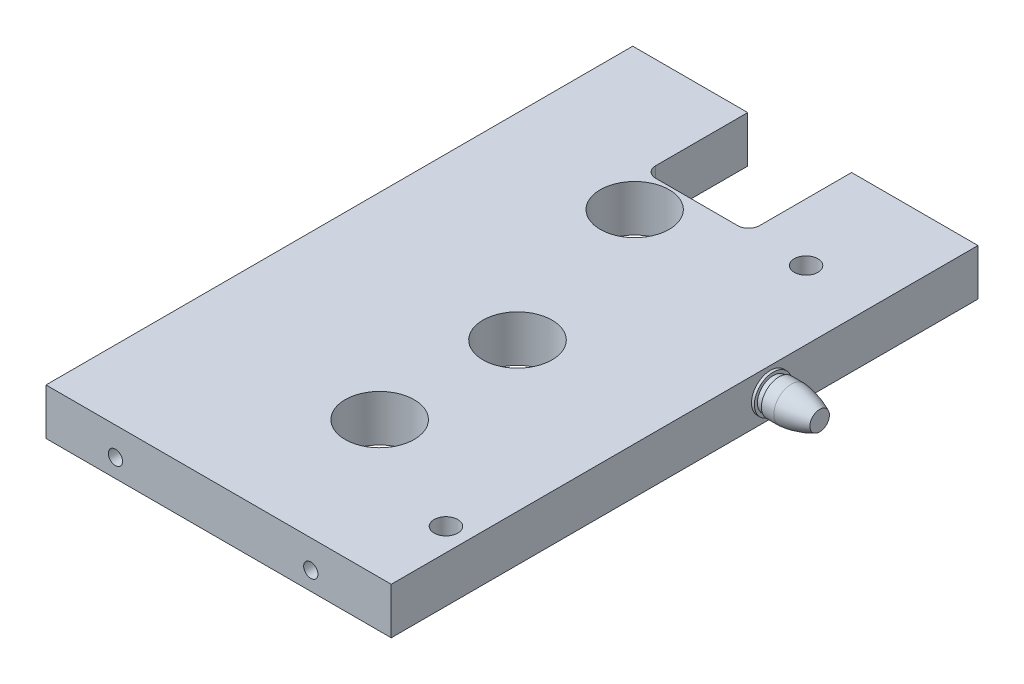
ISO-10303-21;
HEADER;
FILE_DESCRIPTION(('STEP AP214'),'2;1');
FILE_NAME('part.step','',(''),(''),'','','');
FILE_SCHEMA(('AUTOMOTIVE_DESIGN { 1 0 10303 214 1 1 1 1 }'));
ENDSEC;
DATA;
#1=APPLICATION_CONTEXT('core data for automotive mechanical design processes');
#2=APPLICATION_PROTOCOL_DEFINITION('international standard','automotive_design',2000,#1);
#3=PRODUCT_CONTEXT('',#1,'mechanical');
#4=PRODUCT('Part','Part','',(#3));
#5=PRODUCT_RELATED_PRODUCT_CATEGORY('part','',(#4));
#6=PRODUCT_DEFINITION_FORMATION('','',#4);
#7=PRODUCT_DEFINITION_CONTEXT('part definition',#1,'design');
#8=PRODUCT_DEFINITION('design','',#6,#7);
#9=PRODUCT_DEFINITION_SHAPE('','',#8);
#10=(LENGTH_UNIT() NAMED_UNIT(*) SI_UNIT(.MILLI.,.METRE.));
#11=(NAMED_UNIT(*) PLANE_ANGLE_UNIT() SI_UNIT($,.RADIAN.));
#12=(NAMED_UNIT(*) SI_UNIT($,.STERADIAN.) SOLID_ANGLE_UNIT());
#13=UNCERTAINTY_MEASURE_WITH_UNIT(LENGTH_MEASURE(1.E-05),#10,'distance_accuracy_value','');
#14=(GEOMETRIC_REPRESENTATION_CONTEXT(3) GLOBAL_UNCERTAINTY_ASSIGNED_CONTEXT((#13)) GLOBAL_UNIT_ASSIGNED_CONTEXT((#10,
#11,#12)) REPRESENTATION_CONTEXT('',''));
#15=CARTESIAN_POINT('',(0.,0.,0.));
#16=DIRECTION('',(0.,0.,1.));
#17=DIRECTION('',(1.,0.,0.));
#18=AXIS2_PLACEMENT_3D('',#15,#16,#17);
#19=CARTESIAN_POINT('',(-257.2,-82.5,28.9681240867132));
#20=DIRECTION('',(0.,0.,-1.));
#21=DIRECTION('',(-1.,0.,0.));
#22=AXIS2_PLACEMENT_3D('',#19,#20,#21);
#23=CYLINDRICAL_SURFACE('',#22,3.09999999999999);
#24=CARTESIAN_POINT('',(-257.2,-82.5,0.));
#25=DIRECTION('',(0.,0.,1.));
#26=DIRECTION('',(1.,0.,0.));
#27=AXIS2_PLACEMENT_3D('',#24,#25,#26);
#28=CIRCLE('',#27,3.09999999999999);
#29=CARTESIAN_POINT('',(-254.1,-82.5,0.));
#30=VERTEX_POINT('',#29);
#31=EDGE_CURVE('E217',#30,#30,#28,.T.);
#32=ORIENTED_EDGE('',*,*,#31,.F.);
#33=EDGE_LOOP('',(#32));
#34=FACE_BOUND('',#33,.T.);
#35=CARTESIAN_POINT('',(-257.2,-82.5,20.2));
#36=DIRECTION('',(0.,0.,1.));
#37=DIRECTION('',(1.,0.,0.));
#38=AXIS2_PLACEMENT_3D('',#35,#36,#37);
#39=CIRCLE('',#38,3.09999999999999);
#40=CARTESIAN_POINT('',(-256.848432083375,-85.58,20.2));
#41=VERTEX_POINT('',#40);
#42=CARTESIAN_POINT('',(-257.551567916625,-85.58,20.2));
#43=VERTEX_POINT('',#42);
#44=EDGE_CURVE('E138',#41,#43,#39,.T.);
#45=ORIENTED_EDGE('',*,*,#44,.T.);
#46=DIRECTION('',(0.,0.,-1.));
#47=VECTOR('',#46,1.);
#48=CARTESIAN_POINT('',(-257.551567916625,-85.58,28.9681240867132));
#49=LINE('',#48,#47);
#50=CARTESIAN_POINT('',(-257.551567916625,-85.58,19.8613272153188));
#51=VERTEX_POINT('',#50);
#52=EDGE_CURVE('E50',#43,#51,#49,.T.);
#53=ORIENTED_EDGE('',*,*,#52,.T.);
#54=CARTESIAN_POINT('',(-256.848432083375,-85.58,19.5693427331078));
#55=CARTESIAN_POINT('',(-256.907836533533,-85.5867825790089,19.5912680193791));
#56=CARTESIAN_POINT('',(-256.96719185592,-85.5918149847107,19.6138537564495));
#57=CARTESIAN_POINT('',(-257.085419115516,-85.5984451808167,19.6602024908549));
#58=CARTESIAN_POINT('',(-257.144291985608,-85.6000537146995,19.6839615656487));
#59=CARTESIAN_POINT('',(-257.261543057596,-85.599943539512,19.7326512016025));
#60=CARTESIAN_POINT('',(-257.319921276302,-85.5982249439608,19.7575817227653));
#61=CARTESIAN_POINT('',(-257.436197094981,-85.591539167004,19.8086127408628));
#62=CARTESIAN_POINT('',(-257.494092599788,-85.5865617621281,19.8347166781873));
#63=CARTESIAN_POINT('',(-257.551567916625,-85.58,19.8613272153188));
#64=B_SPLINE_CURVE_WITH_KNOTS('',3,(#54,#55,#56,#57,#58,#59,#60,#61,#62,#63),.UNSPECIFIED.,.F.,
.F.,(4,2,2,2,4),(0.,0.191016695142209,0.381433126124509,0.571843060357759,0.762853225634808),.UNSPECIFIED.);
#65=CARTESIAN_POINT('',(-256.848432083375,-85.58,19.5693427331078));
#66=VERTEX_POINT('',#65);
#67=EDGE_CURVE('E11',#66,#51,#64,.T.);
#68=ORIENTED_EDGE('',*,*,#67,.F.);
#69=DIRECTION('',(0.,0.,-1.));
#70=VECTOR('',#69,1.);
#71=CARTESIAN_POINT('',(-256.848432083375,-85.58,28.9681240867132));
#72=LINE('',#71,#70);
#73=EDGE_CURVE('E132',#66,#41,#72,.F.);
#74=ORIENTED_EDGE('',*,*,#73,.T.);
#75=EDGE_LOOP('',(#45,#53,#68,#74));
#76=FACE_BOUND('',#75,.T.);
#77=ADVANCED_FACE('F30',(#34,#76),#23,.F.);
#78=CARTESIAN_POINT('',(-282.25,-691.394504988286,20.2));
#79=DIRECTION('',(0.,0.,1.));
#80=DIRECTION('',(1.,0.,0.));
#81=AXIS2_PLACEMENT_3D('',#78,#79,#80);
#82=PLANE('',#81);
#83=DIRECTION('',(1.,0.,0.));
#84=VECTOR('',#83,1.);
#85=CARTESIAN_POINT('',(-282.25,-85.58,20.2));
#86=LINE('',#85,#84);
#87=EDGE_CURVE('E144',#43,#41,#86,.T.);
#88=ORIENTED_EDGE('',*,*,#87,.F.);
#89=ORIENTED_EDGE('',*,*,#44,.F.);
#90=EDGE_LOOP('',(#88,#89));
#91=FACE_BOUND('',#90,.T.);
#92=ADVANCED_FACE('F377',(#91),#82,.F.);
#93=CARTESIAN_POINT('',(-253.55,-88.901,28.505));
#94=DIRECTION('',(0.,1.,0.));
#95=DIRECTION('',(-1.,0.,0.));
#96=AXIS2_PLACEMENT_3D('',#93,#94,#95);
#97=CYLINDRICAL_SURFACE('',#96,3.26500000000004);
#98=CARTESIAN_POINT('',(-253.55,-76.1000000000001,28.505));
#99=DIRECTION('',(0.,1.,0.));
#100=DIRECTION('',(-1.,0.,0.));
#101=AXIS2_PLACEMENT_3D('',#98,#99,#100);
#102=CIRCLE('',#101,3.26500000000004);
#103=CARTESIAN_POINT('',(-256.815,-76.1000000000001,28.505));
#104=VERTEX_POINT('',#103);
#105=EDGE_CURVE('E149',#104,#104,#102,.T.);
#106=ORIENTED_EDGE('',*,*,#105,.T.);
#107=EDGE_LOOP('',(#106));
#108=FACE_BOUND('',#107,.T.);
#109=CARTESIAN_POINT('',(-253.55,-85.58,28.505));
#110=DIRECTION('',(0.,-1.,0.));
#111=DIRECTION('',(1.,0.,0.));
#112=AXIS2_PLACEMENT_3D('',#109,#110,#111);
#113=CIRCLE('',#112,3.26500000000004);
#114=CARTESIAN_POINT('',(-250.285,-85.58,28.505));
#115=VERTEX_POINT('',#114);
#116=EDGE_CURVE('E133',#115,#115,#113,.F.);
#117=ORIENTED_EDGE('',*,*,#116,.F.);
#118=EDGE_LOOP('',(#117));
#119=FACE_BOUND('',#118,.T.);
#120=ADVANCED_FACE('F382',(#108,#119),#97,.F.);
#121=CARTESIAN_POINT('',(-234.625,-76.1,0.));
#122=DIRECTION('',(0.,0.,1.));
#123=DIRECTION('',(1.,0.,0.));
#124=AXIS2_PLACEMENT_3D('',#121,#122,#123);
#125=PLANE('',#124);
#126=CARTESIAN_POINT('',(-320.5,-82.5,0.));
#127=DIRECTION('',(0.,0.,1.));
#128=DIRECTION('',(1.,0.,0.));
#129=AXIS2_PLACEMENT_3D('',#126,#127,#128);
#130=CIRCLE('',#129,2.39499999999998);
#131=CARTESIAN_POINT('',(-318.105,-82.5,0.));
#132=VERTEX_POINT('',#131);
#133=EDGE_CURVE('E205',#132,#132,#130,.T.);
#134=ORIENTED_EDGE('',*,*,#133,.T.);
#135=EDGE_LOOP('',(#134));
#136=FACE_BOUND('',#135,.T.);
#137=CARTESIAN_POINT('',(-308.,-82.5,0.));
#138=DIRECTION('',(0.,0.,1.));
#139=DIRECTION('',(1.,0.,0.));
#140=AXIS2_PLACEMENT_3D('',#137,#138,#139);
#141=CIRCLE('',#140,3.09999999999999);
#142=CARTESIAN_POINT('',(-304.9,-82.5,0.));
#143=VERTEX_POINT('',#142);
#144=EDGE_CURVE('E221',#143,#143,#141,.T.);
#145=ORIENTED_EDGE('',*,*,#144,.T.);
#146=EDGE_LOOP('',(#145));
#147=FACE_BOUND('',#146,.T.);
#148=DIRECTION('',(-1.,0.,0.));
#149=VECTOR('',#148,1.);
#150=CARTESIAN_POINT('',(-234.625,-76.1,0.));
#151=LINE('',#150,#149);
#152=CARTESIAN_POINT('',(-298.155,-76.1000000000001,0.));
#153=VERTEX_POINT('',#152);
#154=CARTESIAN_POINT('',(-329.875,-76.1000000000001,0.));
#155=VERTEX_POINT('',#154);
#156=EDGE_CURVE('E240',#153,#155,#151,.T.);
#157=ORIENTED_EDGE('',*,*,#156,.F.);
#158=DIRECTION('',(0.,1.,0.));
#159=VECTOR('',#158,1.);
#160=CARTESIAN_POINT('',(-298.155,-88.901,0.));
#161=LINE('',#160,#159);
#162=CARTESIAN_POINT('',(-298.155,-88.9,0.));
#163=VERTEX_POINT('',#162);
#164=EDGE_CURVE('E197',#163,#153,#161,.T.);
#165=ORIENTED_EDGE('',*,*,#164,.F.);
#166=DIRECTION('',(-1.,0.,0.));
#167=VECTOR('',#166,1.);
#168=CARTESIAN_POINT('',(-234.625,-88.8999999999999,0.));
#169=LINE('',#168,#167);
#170=CARTESIAN_POINT('',(-329.875,-88.9,0.));
#171=VERTEX_POINT('',#170);
#172=EDGE_CURVE('E232',#163,#171,#169,.T.);
#173=ORIENTED_EDGE('',*,*,#172,.T.);
#174=DIRECTION('',(0.,1.,0.));
#175=VECTOR('',#174,1.);
#176=CARTESIAN_POINT('',(-329.875,-88.9,0.));
#177=LINE('',#176,#175);
#178=EDGE_CURVE('E231',#171,#155,#177,.T.);
#179=ORIENTED_EDGE('',*,*,#178,.T.);
#180=EDGE_LOOP('',(#157,#165,#173,#179));
#181=FACE_BOUND('',#180,.T.);
#182=ADVANCED_FACE('F341',(#136,#147,#181),#125,.F.);
#183=CARTESIAN_POINT('',(-244.2,-82.5,0.));
#184=DIRECTION('',(0.,0.,1.));
#185=DIRECTION('',(1.,0.,0.));
#186=AXIS2_PLACEMENT_3D('',#183,#184,#185);
#187=CIRCLE('',#186,2.39499999999998);
#188=CARTESIAN_POINT('',(-241.805,-82.5,0.));
#189=VERTEX_POINT('',#188);
#190=EDGE_CURVE('E211',#189,#189,#187,.T.);
#191=ORIENTED_EDGE('',*,*,#190,.T.);
#192=EDGE_LOOP('',(#191));
#193=FACE_BOUND('',#192,.T.);
#194=CARTESIAN_POINT('',(-234.625,-88.8999999999999,0.));
#195=VERTEX_POINT('',#194);
#196=CARTESIAN_POINT('',(-269.505,-88.8999999999999,0.));
#197=VERTEX_POINT('',#196);
#198=EDGE_CURVE('E228',#195,#197,#169,.T.);
#199=ORIENTED_EDGE('',*,*,#198,.T.);
#200=DIRECTION('',(0.,1.,0.));
#201=VECTOR('',#200,1.);
#202=CARTESIAN_POINT('',(-269.505,-88.901,0.));
#203=LINE('',#202,#201);
#204=CARTESIAN_POINT('',(-269.505,-76.1000000000001,0.));
#205=VERTEX_POINT('',#204);
#206=EDGE_CURVE('E199',#197,#205,#203,.T.);
#207=ORIENTED_EDGE('',*,*,#206,.T.);
#208=CARTESIAN_POINT('',(-234.625,-76.1,0.));
#209=VERTEX_POINT('',#208);
#210=EDGE_CURVE('E236',#209,#205,#151,.T.);
#211=ORIENTED_EDGE('',*,*,#210,.F.);
#212=DIRECTION('',(0.,1.,0.));
#213=VECTOR('',#212,1.);
#214=CARTESIAN_POINT('',(-234.625,-88.8999999999999,0.));
#215=LINE('',#214,#213);
#216=EDGE_CURVE('E43',#195,#209,#215,.T.);
#217=ORIENTED_EDGE('',*,*,#216,.F.);
#218=EDGE_LOOP('',(#199,#207,#211,#217));
#219=FACE_BOUND('',#218,.T.);
#220=ORIENTED_EDGE('',*,*,#31,.T.);
#221=EDGE_LOOP('',(#220));
#222=FACE_BOUND('',#221,.T.);
#223=ADVANCED_FACE('F357',(#193,#219,#222),#125,.F.);
#224=CARTESIAN_POINT('',(-329.875,-610.1,161.88));
#225=DIRECTION('',(0.,0.,1.));
#226=DIRECTION('',(1.,0.,0.));
#227=AXIS2_PLACEMENT_3D('',#224,#225,#226);
#228=PLANE('',#227);
#229=CARTESIAN_POINT('',(-310.715,-83.83,161.88));
#230=DIRECTION('',(0.,0.,1.));
#231=DIRECTION('',(1.,0.,0.));
#232=AXIS2_PLACEMENT_3D('',#229,#230,#231);
#233=CIRCLE('',#232,1.965);
#234=CARTESIAN_POINT('',(-308.75,-83.83,161.88));
#235=VERTEX_POINT('',#234);
#236=EDGE_CURVE('E273',#235,#235,#233,.T.);
#237=ORIENTED_EDGE('',*,*,#236,.F.);
#238=EDGE_LOOP('',(#237));
#239=FACE_BOUND('',#238,.T.);
#240=CARTESIAN_POINT('',(-256.825,-83.83,161.88));
#241=DIRECTION('',(0.,0.,1.));
#242=DIRECTION('',(1.,0.,0.));
#243=AXIS2_PLACEMENT_3D('',#240,#241,#242);
#244=CIRCLE('',#243,1.965);
#245=CARTESIAN_POINT('',(-254.86,-83.83,161.88));
#246=VERTEX_POINT('',#245);
#247=EDGE_CURVE('E267',#246,#246,#244,.T.);
#248=ORIENTED_EDGE('',*,*,#247,.F.);
#249=EDGE_LOOP('',(#248));
#250=FACE_BOUND('',#249,.T.);
#251=DIRECTION('',(-1.,0.,0.));
#252=VECTOR('',#251,1.);
#253=CARTESIAN_POINT('',(-234.625,-88.8999999999999,161.88));
#254=LINE('',#253,#252);
#255=CARTESIAN_POINT('',(-234.625,-88.8999999999999,161.88));
#256=VERTEX_POINT('',#255);
#257=CARTESIAN_POINT('',(-329.875,-88.9,161.88));
#258=VERTEX_POINT('',#257);
#259=EDGE_CURVE('E235',#256,#258,#254,.T.);
#260=ORIENTED_EDGE('',*,*,#259,.F.);
#261=DIRECTION('',(0.,1.,0.));
#262=VECTOR('',#261,1.);
#263=CARTESIAN_POINT('',(-234.625,-88.8999999999999,161.88));
#264=LINE('',#263,#262);
#265=CARTESIAN_POINT('',(-234.625,-76.1,161.88));
#266=VERTEX_POINT('',#265);
#267=EDGE_CURVE('E227',#256,#266,#264,.T.);
#268=ORIENTED_EDGE('',*,*,#267,.T.);
#269=DIRECTION('',(-1.,0.,0.));
#270=VECTOR('',#269,1.);
#271=CARTESIAN_POINT('',(-234.625,-76.1,161.88));
#272=LINE('',#271,#270);
#273=CARTESIAN_POINT('',(-329.875,-76.1000000000001,161.88));
#274=VERTEX_POINT('',#273);
#275=EDGE_CURVE('E247',#266,#274,#272,.T.);
#276=ORIENTED_EDGE('',*,*,#275,.T.);
#277=DIRECTION('',(0.,1.,0.));
#278=VECTOR('',#277,1.);
#279=CARTESIAN_POINT('',(-329.875,-88.9,161.88));
#280=LINE('',#279,#278);
#281=EDGE_CURVE('E249',#258,#274,#280,.T.);
#282=ORIENTED_EDGE('',*,*,#281,.F.);
#283=EDGE_LOOP('',(#260,#268,#276,#282));
#284=FACE_BOUND('',#283,.T.);
#285=ADVANCED_FACE('F32',(#239,#250,#284),#228,.T.);
#286=CARTESIAN_POINT('',(-234.625,-88.8999999999999,257.98620427423));
#287=DIRECTION('',(0.,-1.,0.));
#288=DIRECTION('',(1.,0.,0.));
#289=AXIS2_PLACEMENT_3D('',#286,#287,#288);
#290=PLANE('',#289);
#291=CARTESIAN_POINT('',(-290.57,-88.9,38.77));
#292=DIRECTION('',(0.,1.,0.));
#293=DIRECTION('',(-1.,0.,0.));
#294=AXIS2_PLACEMENT_3D('',#291,#292,#293);
#295=CIRCLE('',#294,9.50000000000001);
#296=CARTESIAN_POINT('',(-300.07,-88.9,38.77));
#297=VERTEX_POINT('',#296);
#298=EDGE_CURVE('E297',#297,#297,#295,.T.);
#299=ORIENTED_EDGE('',*,*,#298,.T.);
#300=EDGE_LOOP('',(#299));
#301=FACE_BOUND('',#300,.T.);
#302=CARTESIAN_POINT('',(-253.55,-88.9,28.505));
#303=DIRECTION('',(0.,-1.,0.));
#304=DIRECTION('',(1.,0.,0.));
#305=AXIS2_PLACEMENT_3D('',#302,#303,#304);
#306=CIRCLE('',#305,9.52500000000002);
#307=CARTESIAN_POINT('',(-244.025,-88.9,28.505));
#308=VERTEX_POINT('',#307);
#309=EDGE_CURVE('E134',#308,#308,#306,.T.);
#310=ORIENTED_EDGE('',*,*,#309,.F.);
#311=EDGE_LOOP('',(#310));
#312=FACE_BOUND('',#311,.T.);
#313=CARTESIAN_POINT('',(-240.925,-88.8999999999999,140.49));
#314=DIRECTION('',(0.,-1.,0.));
#315=DIRECTION('',(1.,0.,0.));
#316=AXIS2_PLACEMENT_3D('',#313,#314,#315);
#317=CIRCLE('',#316,3.26500000000004);
#318=CARTESIAN_POINT('',(-237.66,-88.8999999999999,140.49));
#319=VERTEX_POINT('',#318);
#320=EDGE_CURVE('E139',#319,#319,#317,.F.);
#321=ORIENTED_EDGE('',*,*,#320,.T.);
#322=EDGE_LOOP('',(#321));
#323=FACE_BOUND('',#322,.T.);
#324=CARTESIAN_POINT('',(-275.57,-88.8999999999999,124.135));
#325=DIRECTION('',(0.,-1.,0.));
#326=DIRECTION('',(1.,0.,0.));
#327=AXIS2_PLACEMENT_3D('',#324,#325,#326);
#328=CIRCLE('',#327,9.52500000000002);
#329=CARTESIAN_POINT('',(-266.045,-88.8999999999999,124.135));
#330=VERTEX_POINT('',#329);
#331=EDGE_CURVE('E153',#330,#330,#328,.F.);
#332=ORIENTED_EDGE('',*,*,#331,.T.);
#333=EDGE_LOOP('',(#332));
#334=FACE_BOUND('',#333,.T.);
#335=CARTESIAN_POINT('',(-275.57,-88.8999999999999,86.105));
#336=DIRECTION('',(0.,-1.,0.));
#337=DIRECTION('',(1.,0.,0.));
#338=AXIS2_PLACEMENT_3D('',#335,#336,#337);
#339=CIRCLE('',#338,9.52500000000002);
#340=CARTESIAN_POINT('',(-266.045,-88.8999999999999,86.105));
#341=VERTEX_POINT('',#340);
#342=EDGE_CURVE('E157',#341,#341,#339,.F.);
#343=ORIENTED_EDGE('',*,*,#342,.T.);
#344=EDGE_LOOP('',(#343));
#345=FACE_BOUND('',#344,.T.);
#346=DIRECTION('',(0.,0.,1.));
#347=VECTOR('',#346,1.);
#348=CARTESIAN_POINT('',(-298.155,-88.9,0.));
#349=LINE('',#348,#347);
#350=CARTESIAN_POINT('',(-298.155,-88.9,25.4));
#351=VERTEX_POINT('',#350);
#352=EDGE_CURVE('E174',#163,#351,#349,.T.);
#353=ORIENTED_EDGE('',*,*,#352,.T.);
#354=CARTESIAN_POINT('',(-295.155,-88.9,25.4));
#355=DIRECTION('',(0.,-1.,0.));
#356=DIRECTION('',(1.,0.,0.));
#357=AXIS2_PLACEMENT_3D('',#354,#355,#356);
#358=CIRCLE('',#357,3.);
#359=CARTESIAN_POINT('',(-295.155,-88.9,28.4));
#360=VERTEX_POINT('',#359);
#361=EDGE_CURVE('E171',#351,#360,#358,.F.);
#362=ORIENTED_EDGE('',*,*,#361,.T.);
#363=DIRECTION('',(1.,0.,0.));
#364=VECTOR('',#363,1.);
#365=CARTESIAN_POINT('',(-295.155,-88.9,28.4));
#366=LINE('',#365,#364);
#367=CARTESIAN_POINT('',(-272.505,-88.8999999999999,28.4));
#368=VERTEX_POINT('',#367);
#369=EDGE_CURVE('E168',#360,#368,#366,.T.);
#370=ORIENTED_EDGE('',*,*,#369,.T.);
#371=CARTESIAN_POINT('',(-272.505,-88.8999999999999,25.4));
#372=DIRECTION('',(0.,-1.,0.));
#373=DIRECTION('',(1.,0.,0.));
#374=AXIS2_PLACEMENT_3D('',#371,#372,#373);
#375=CIRCLE('',#374,3.);
#376=CARTESIAN_POINT('',(-269.505,-88.8999999999999,25.4));
#377=VERTEX_POINT('',#376);
#378=EDGE_CURVE('E163',#368,#377,#375,.F.);
#379=ORIENTED_EDGE('',*,*,#378,.T.);
#380=DIRECTION('',(0.,0.,-1.));
#381=VECTOR('',#380,1.);
#382=CARTESIAN_POINT('',(-269.505,-88.8999999999999,25.4));
#383=LINE('',#382,#381);
#384=EDGE_CURVE('E192',#377,#197,#383,.T.);
#385=ORIENTED_EDGE('',*,*,#384,.T.);
#386=ORIENTED_EDGE('',*,*,#198,.F.);
#387=DIRECTION('',(0.,0.,-1.));
#388=VECTOR('',#387,1.);
#389=CARTESIAN_POINT('',(-234.625,-88.8999999999999,257.98620427423));
#390=LINE('',#389,#388);
#391=EDGE_CURVE('E239',#256,#195,#390,.T.);
#392=ORIENTED_EDGE('',*,*,#391,.F.);
#393=ORIENTED_EDGE('',*,*,#259,.T.);
#394=DIRECTION('',(0.,0.,-1.));
#395=VECTOR('',#394,1.);
#396=CARTESIAN_POINT('',(-329.875,-88.9,257.98620427423));
#397=LINE('',#396,#395);
#398=EDGE_CURVE('E245',#258,#171,#397,.T.);
#399=ORIENTED_EDGE('',*,*,#398,.T.);
#400=ORIENTED_EDGE('',*,*,#172,.F.);
#401=EDGE_LOOP('',(#353,#362,#370,#379,#385,#386,#392,#393,#399,#400));
#402=FACE_BOUND('',#401,.T.);
#403=ADVANCED_FACE('F304',(#301,#312,#323,#334,#345,#402),#290,.T.);
#404=CARTESIAN_POINT('',(-329.875,-88.9,257.98620427423));
#405=DIRECTION('',(-1.,0.,0.));
#406=DIRECTION('',(0.,0.,1.));
#407=AXIS2_PLACEMENT_3D('',#404,#405,#406);
#408=PLANE('',#407);
#409=ORIENTED_EDGE('',*,*,#398,.F.);
#410=ORIENTED_EDGE('',*,*,#281,.T.);
#411=DIRECTION('',(0.,0.,-1.));
#412=VECTOR('',#411,1.);
#413=CARTESIAN_POINT('',(-329.875,-76.1000000000001,257.98620427423));
#414=LINE('',#413,#412);
#415=EDGE_CURVE('E252',#274,#155,#414,.T.);
#416=ORIENTED_EDGE('',*,*,#415,.T.);
#417=ORIENTED_EDGE('',*,*,#178,.F.);
#418=EDGE_LOOP('',(#409,#410,#416,#417));
#419=FACE_BOUND('',#418,.T.);
#420=ADVANCED_FACE('F318',(#419),#408,.T.);
#421=CARTESIAN_POINT('',(-234.625,-76.1,257.98620427423));
#422=DIRECTION('',(0.,-1.,0.));
#423=DIRECTION('',(1.,0.,0.));
#424=AXIS2_PLACEMENT_3D('',#421,#422,#423);
#425=PLANE('',#424);
#426=CARTESIAN_POINT('',(-290.57,-76.1000000000001,38.77));
#427=DIRECTION('',(0.,1.,0.));
#428=DIRECTION('',(-1.,0.,0.));
#429=AXIS2_PLACEMENT_3D('',#426,#427,#428);
#430=CIRCLE('',#429,9.50000000000001);
#431=CARTESIAN_POINT('',(-300.07,-76.1000000000001,38.77));
#432=VERTEX_POINT('',#431);
#433=EDGE_CURVE('E298',#432,#432,#430,.T.);
#434=ORIENTED_EDGE('',*,*,#433,.F.);
#435=EDGE_LOOP('',(#434));
#436=FACE_BOUND('',#435,.T.);
#437=CARTESIAN_POINT('',(-240.925,-76.1000000000001,140.49));
#438=DIRECTION('',(0.,1.,0.));
#439=DIRECTION('',(-1.,0.,0.));
#440=AXIS2_PLACEMENT_3D('',#437,#438,#439);
#441=CIRCLE('',#440,3.26500000000004);
#442=CARTESIAN_POINT('',(-244.19,-76.1000000000001,140.49));
#443=VERTEX_POINT('',#442);
#444=EDGE_CURVE('E142',#443,#443,#441,.T.);
#445=ORIENTED_EDGE('',*,*,#444,.F.);
#446=EDGE_LOOP('',(#445));
#447=FACE_BOUND('',#446,.T.);
#448=ORIENTED_EDGE('',*,*,#105,.F.);
#449=EDGE_LOOP('',(#448));
#450=FACE_BOUND('',#449,.T.);
#451=CARTESIAN_POINT('',(-275.57,-76.1000000000001,124.135));
#452=DIRECTION('',(0.,1.,0.));
#453=DIRECTION('',(-1.,0.,0.));
#454=AXIS2_PLACEMENT_3D('',#451,#452,#453);
#455=CIRCLE('',#454,9.52500000000002);
#456=CARTESIAN_POINT('',(-285.095,-76.1000000000001,124.135));
#457=VERTEX_POINT('',#456);
#458=EDGE_CURVE('E154',#457,#457,#455,.T.);
#459=ORIENTED_EDGE('',*,*,#458,.F.);
#460=EDGE_LOOP('',(#459));
#461=FACE_BOUND('',#460,.T.);
#462=CARTESIAN_POINT('',(-275.57,-76.1000000000001,86.105));
#463=DIRECTION('',(0.,1.,0.));
#464=DIRECTION('',(-1.,0.,0.));
#465=AXIS2_PLACEMENT_3D('',#462,#463,#464);
#466=CIRCLE('',#465,9.52500000000002);
#467=CARTESIAN_POINT('',(-285.095,-76.1000000000001,86.105));
#468=VERTEX_POINT('',#467);
#469=EDGE_CURVE('E160',#468,#468,#466,.T.);
#470=ORIENTED_EDGE('',*,*,#469,.F.);
#471=EDGE_LOOP('',(#470));
#472=FACE_BOUND('',#471,.T.);
#473=CARTESIAN_POINT('',(-295.155,-76.1000000000001,25.4));
#474=DIRECTION('',(0.,1.,0.));
#475=DIRECTION('',(-1.,0.,0.));
#476=AXIS2_PLACEMENT_3D('',#473,#474,#475);
#477=CIRCLE('',#476,3.);
#478=CARTESIAN_POINT('',(-298.155,-76.1000000000001,25.4));
#479=VERTEX_POINT('',#478);
#480=CARTESIAN_POINT('',(-295.155,-76.1000000000001,28.4));
#481=VERTEX_POINT('',#480);
#482=EDGE_CURVE('E183',#479,#481,#477,.T.);
#483=ORIENTED_EDGE('',*,*,#482,.F.);
#484=DIRECTION('',(0.,0.,1.));
#485=VECTOR('',#484,1.);
#486=CARTESIAN_POINT('',(-298.155,-76.1000000000001,0.));
#487=LINE('',#486,#485);
#488=EDGE_CURVE('E180',#153,#479,#487,.T.);
#489=ORIENTED_EDGE('',*,*,#488,.F.);
#490=ORIENTED_EDGE('',*,*,#156,.T.);
#491=ORIENTED_EDGE('',*,*,#415,.F.);
#492=ORIENTED_EDGE('',*,*,#275,.F.);
#493=DIRECTION('',(0.,0.,-1.));
#494=VECTOR('',#493,1.);
#495=CARTESIAN_POINT('',(-234.625,-76.1,257.98620427423));
#496=LINE('',#495,#494);
#497=EDGE_CURVE('E253',#266,#209,#496,.T.);
#498=ORIENTED_EDGE('',*,*,#497,.T.);
#499=ORIENTED_EDGE('',*,*,#210,.T.);
#500=DIRECTION('',(0.,0.,-1.));
#501=VECTOR('',#500,1.);
#502=CARTESIAN_POINT('',(-269.505,-76.1000000000001,25.4));
#503=LINE('',#502,#501);
#504=CARTESIAN_POINT('',(-269.505,-76.1,25.4));
#505=VERTEX_POINT('',#504);
#506=EDGE_CURVE('E178',#505,#205,#503,.T.);
#507=ORIENTED_EDGE('',*,*,#506,.F.);
#508=CARTESIAN_POINT('',(-272.505,-76.1000000000001,25.4));
#509=DIRECTION('',(0.,1.,0.));
#510=DIRECTION('',(-1.,0.,0.));
#511=AXIS2_PLACEMENT_3D('',#508,#509,#510);
#512=CIRCLE('',#511,3.);
#513=CARTESIAN_POINT('',(-272.505,-76.1000000000001,28.4));
#514=VERTEX_POINT('',#513);
#515=EDGE_CURVE('E58',#514,#505,#512,.T.);
#516=ORIENTED_EDGE('',*,*,#515,.F.);
#517=DIRECTION('',(1.,0.,0.));
#518=VECTOR('',#517,1.);
#519=CARTESIAN_POINT('',(-295.155,-76.1000000000001,28.4));
#520=LINE('',#519,#518);
#521=EDGE_CURVE('E186',#481,#514,#520,.T.);
#522=ORIENTED_EDGE('',*,*,#521,.F.);
#523=EDGE_LOOP('',(#483,#489,#490,#491,#492,#498,#499,#507,#516,#522));
#524=FACE_BOUND('',#523,.T.);
#525=ADVANCED_FACE('F314',(#436,#447,#450,#461,#472,#524),#425,.F.);
#526=CARTESIAN_POINT('',(-234.625,-88.8999999999999,257.98620427423));
#527=DIRECTION('',(-1.,0.,0.));
#528=DIRECTION('',(0.,0.,1.));
#529=AXIS2_PLACEMENT_3D('',#526,#527,#528);
#530=PLANE('',#529);
#531=CARTESIAN_POINT('',(-234.625,-82.5,57.29));
#532=DIRECTION('',(1.,0.,0.));
#533=DIRECTION('',(0.,1.,0.));
#534=AXIS2_PLACEMENT_3D('',#531,#532,#533);
#535=CIRCLE('',#534,5.2);
#536=CARTESIAN_POINT('',(-234.625,-77.3,57.29));
#537=VERTEX_POINT('',#536);
#538=EDGE_CURVE('E276',#537,#537,#535,.T.);
#539=ORIENTED_EDGE('',*,*,#538,.F.);
#540=EDGE_LOOP('',(#539));
#541=FACE_BOUND('',#540,.T.);
#542=ORIENTED_EDGE('',*,*,#267,.F.);
#543=ORIENTED_EDGE('',*,*,#391,.T.);
#544=ORIENTED_EDGE('',*,*,#216,.T.);
#545=ORIENTED_EDGE('',*,*,#497,.F.);
#546=EDGE_LOOP('',(#542,#543,#544,#545));
#547=FACE_BOUND('',#546,.T.);
#548=ADVANCED_FACE('F317',(#541,#547),#530,.F.);
#549=CARTESIAN_POINT('',(-308.,-82.5,28.9681240867132));
#550=DIRECTION('',(0.,0.,-1.));
#551=DIRECTION('',(-1.,0.,0.));
#552=AXIS2_PLACEMENT_3D('',#549,#550,#551);
#553=CYLINDRICAL_SURFACE('',#552,3.09999999999999);
#554=ORIENTED_EDGE('',*,*,#144,.F.);
#555=EDGE_LOOP('',(#554));
#556=FACE_BOUND('',#555,.T.);
#557=CARTESIAN_POINT('',(-308.,-82.5,20.2));
#558=DIRECTION('',(0.,0.,1.));
#559=DIRECTION('',(1.,0.,0.));
#560=AXIS2_PLACEMENT_3D('',#557,#558,#559);
#561=CIRCLE('',#560,3.09999999999999);
#562=CARTESIAN_POINT('',(-304.9,-82.5,20.2));
#563=VERTEX_POINT('',#562);
#564=EDGE_CURVE('E224',#563,#563,#561,.T.);
#565=ORIENTED_EDGE('',*,*,#564,.T.);
#566=EDGE_LOOP('',(#565));
#567=FACE_BOUND('',#566,.T.);
#568=ADVANCED_FACE('F391',(#556,#567),#553,.F.);
#569=CARTESIAN_POINT('',(-282.25,-691.394504988286,20.2));
#570=DIRECTION('',(0.,0.,1.));
#571=DIRECTION('',(1.,0.,0.));
#572=AXIS2_PLACEMENT_3D('',#569,#570,#571);
#573=PLANE('',#572);
#574=ORIENTED_EDGE('',*,*,#564,.F.);
#575=EDGE_LOOP('',(#574));
#576=FACE_BOUND('',#575,.T.);
#577=ADVANCED_FACE('F394',(#576),#573,.F.);
#578=CARTESIAN_POINT('',(-244.2,-82.5,28.2740829637671));
#579=DIRECTION('',(0.,0.,-1.));
#580=DIRECTION('',(-1.,0.,0.));
#581=AXIS2_PLACEMENT_3D('',#578,#579,#580);
#582=CYLINDRICAL_SURFACE('',#581,2.39499999999998);
#583=ORIENTED_EDGE('',*,*,#190,.F.);
#584=EDGE_LOOP('',(#583));
#585=FACE_BOUND('',#584,.T.);
#586=CARTESIAN_POINT('',(-244.2,-82.5,21.5));
#587=DIRECTION('',(0.,0.,1.));
#588=DIRECTION('',(1.,0.,0.));
#589=AXIS2_PLACEMENT_3D('',#586,#587,#588);
#590=CIRCLE('',#589,2.39499999999998);
#591=CARTESIAN_POINT('',(-241.805,-82.5,21.5));
#592=VERTEX_POINT('',#591);
#593=EDGE_CURVE('E214',#592,#592,#590,.T.);
#594=ORIENTED_EDGE('',*,*,#593,.T.);
#595=EDGE_LOOP('',(#594));
#596=FACE_BOUND('',#595,.T.);
#597=ADVANCED_FACE('F398',(#585,#596),#582,.F.);
#598=CARTESIAN_POINT('',(-282.25,-691.394504988286,21.5));
#599=DIRECTION('',(0.,0.,1.));
#600=DIRECTION('',(1.,0.,0.));
#601=AXIS2_PLACEMENT_3D('',#598,#599,#600);
#602=PLANE('',#601);
#603=ORIENTED_EDGE('',*,*,#593,.F.);
#604=EDGE_LOOP('',(#603));
#605=FACE_BOUND('',#604,.T.);
#606=ADVANCED_FACE('F388',(#605),#602,.F.);
#607=CARTESIAN_POINT('',(-320.5,-82.5,28.2740829637671));
#608=DIRECTION('',(0.,0.,-1.));
#609=DIRECTION('',(-1.,0.,0.));
#610=AXIS2_PLACEMENT_3D('',#607,#608,#609);
#611=CYLINDRICAL_SURFACE('',#610,2.39499999999998);
#612=ORIENTED_EDGE('',*,*,#133,.F.);
#613=EDGE_LOOP('',(#612));
#614=FACE_BOUND('',#613,.T.);
#615=CARTESIAN_POINT('',(-320.5,-82.5,21.5));
#616=DIRECTION('',(0.,0.,1.));
#617=DIRECTION('',(1.,0.,0.));
#618=AXIS2_PLACEMENT_3D('',#615,#616,#617);
#619=CIRCLE('',#618,2.39499999999998);
#620=CARTESIAN_POINT('',(-318.105,-82.5,21.5));
#621=VERTEX_POINT('',#620);
#622=EDGE_CURVE('E208',#621,#621,#619,.T.);
#623=ORIENTED_EDGE('',*,*,#622,.T.);
#624=EDGE_LOOP('',(#623));
#625=FACE_BOUND('',#624,.T.);
#626=ADVANCED_FACE('F461',(#614,#625),#611,.F.);
#627=CARTESIAN_POINT('',(-282.25,-691.394504988286,21.5));
#628=DIRECTION('',(0.,0.,1.));
#629=DIRECTION('',(1.,0.,0.));
#630=AXIS2_PLACEMENT_3D('',#627,#628,#629);
#631=PLANE('',#630);
#632=ORIENTED_EDGE('',*,*,#622,.F.);
#633=EDGE_LOOP('',(#632));
#634=FACE_BOUND('',#633,.T.);
#635=ADVANCED_FACE('F373',(#634),#631,.F.);
#636=CARTESIAN_POINT('',(-272.505,-88.901,25.4));
#637=DIRECTION('',(0.,1.,0.));
#638=DIRECTION('',(-1.,0.,0.));
#639=AXIS2_PLACEMENT_3D('',#636,#637,#638);
#640=CYLINDRICAL_SURFACE('',#639,3.);
#641=DIRECTION('',(0.,1.,0.));
#642=VECTOR('',#641,1.);
#643=CARTESIAN_POINT('',(-272.505,-88.901,28.4));
#644=LINE('',#643,#642);
#645=EDGE_CURVE('E190',#368,#514,#644,.T.);
#646=ORIENTED_EDGE('',*,*,#645,.T.);
#647=ORIENTED_EDGE('',*,*,#515,.T.);
#648=DIRECTION('',(0.,1.,0.));
#649=VECTOR('',#648,1.);
#650=CARTESIAN_POINT('',(-269.505,-88.901,25.4));
#651=LINE('',#650,#649);
#652=EDGE_CURVE('E189',#377,#505,#651,.T.);
#653=ORIENTED_EDGE('',*,*,#652,.F.);
#654=ORIENTED_EDGE('',*,*,#378,.F.);
#655=EDGE_LOOP('',(#646,#647,#653,#654));
#656=FACE_BOUND('',#655,.T.);
#657=ADVANCED_FACE('F362',(#656),#640,.F.);
#658=CARTESIAN_POINT('',(-295.155,-88.901,28.4));
#659=DIRECTION('',(0.,0.,1.));
#660=DIRECTION('',(1.,0.,0.));
#661=AXIS2_PLACEMENT_3D('',#658,#659,#660);
#662=PLANE('',#661);
#663=DIRECTION('',(0.,1.,0.));
#664=VECTOR('',#663,1.);
#665=CARTESIAN_POINT('',(-295.155,-88.901,28.4));
#666=LINE('',#665,#664);
#667=EDGE_CURVE('E193',#360,#481,#666,.T.);
#668=ORIENTED_EDGE('',*,*,#667,.T.);
#669=ORIENTED_EDGE('',*,*,#521,.T.);
#670=ORIENTED_EDGE('',*,*,#645,.F.);
#671=ORIENTED_EDGE('',*,*,#369,.F.);
#672=EDGE_LOOP('',(#668,#669,#670,#671));
#673=FACE_BOUND('',#672,.T.);
#674=ADVANCED_FACE('F365',(#673),#662,.F.);
#675=CARTESIAN_POINT('',(-295.155,-88.901,25.4));
#676=DIRECTION('',(0.,1.,0.));
#677=DIRECTION('',(-1.,0.,0.));
#678=AXIS2_PLACEMENT_3D('',#675,#676,#677);
#679=CYLINDRICAL_SURFACE('',#678,3.);
#680=DIRECTION('',(0.,1.,0.));
#681=VECTOR('',#680,1.);
#682=CARTESIAN_POINT('',(-298.155,-88.901,25.4));
#683=LINE('',#682,#681);
#684=EDGE_CURVE('E195',#351,#479,#683,.T.);
#685=ORIENTED_EDGE('',*,*,#684,.T.);
#686=ORIENTED_EDGE('',*,*,#482,.T.);
#687=ORIENTED_EDGE('',*,*,#667,.F.);
#688=ORIENTED_EDGE('',*,*,#361,.F.);
#689=EDGE_LOOP('',(#685,#686,#687,#688));
#690=FACE_BOUND('',#689,.T.);
#691=ADVANCED_FACE('F334',(#690),#679,.F.);
#692=CARTESIAN_POINT('',(-298.155,-88.901,0.));
#693=DIRECTION('',(-1.,0.,0.));
#694=DIRECTION('',(0.,-1.,0.));
#695=AXIS2_PLACEMENT_3D('',#692,#693,#694);
#696=PLANE('',#695);
#697=ORIENTED_EDGE('',*,*,#164,.T.);
#698=ORIENTED_EDGE('',*,*,#488,.T.);
#699=ORIENTED_EDGE('',*,*,#684,.F.);
#700=ORIENTED_EDGE('',*,*,#352,.F.);
#701=EDGE_LOOP('',(#697,#698,#699,#700));
#702=FACE_BOUND('',#701,.T.);
#703=ADVANCED_FACE('F337',(#702),#696,.F.);
#704=CARTESIAN_POINT('',(-269.505,-88.901,25.4));
#705=DIRECTION('',(1.,0.,0.));
#706=DIRECTION('',(0.,1.,0.));
#707=AXIS2_PLACEMENT_3D('',#704,#705,#706);
#708=PLANE('',#707);
#709=ORIENTED_EDGE('',*,*,#652,.T.);
#710=ORIENTED_EDGE('',*,*,#506,.T.);
#711=ORIENTED_EDGE('',*,*,#206,.F.);
#712=ORIENTED_EDGE('',*,*,#384,.F.);
#713=EDGE_LOOP('',(#709,#710,#711,#712));
#714=FACE_BOUND('',#713,.T.);
#715=ADVANCED_FACE('F360',(#714),#708,.F.);
#716=CARTESIAN_POINT('',(-275.57,-88.901,86.105));
#717=DIRECTION('',(0.,1.,0.));
#718=DIRECTION('',(-1.,0.,0.));
#719=AXIS2_PLACEMENT_3D('',#716,#717,#718);
#720=CYLINDRICAL_SURFACE('',#719,9.52500000000002);
#721=ORIENTED_EDGE('',*,*,#342,.F.);
#722=EDGE_LOOP('',(#721));
#723=FACE_BOUND('',#722,.T.);
#724=ORIENTED_EDGE('',*,*,#469,.T.);
#725=EDGE_LOOP('',(#724));
#726=FACE_BOUND('',#725,.T.);
#727=ADVANCED_FACE('F445',(#723,#726),#720,.F.);
#728=CARTESIAN_POINT('',(-275.57,-88.901,124.135));
#729=DIRECTION('',(0.,1.,0.));
#730=DIRECTION('',(-1.,0.,0.));
#731=AXIS2_PLACEMENT_3D('',#728,#729,#730);
#732=CYLINDRICAL_SURFACE('',#731,9.52500000000002);
#733=ORIENTED_EDGE('',*,*,#331,.F.);
#734=EDGE_LOOP('',(#733));
#735=FACE_BOUND('',#734,.T.);
#736=ORIENTED_EDGE('',*,*,#458,.T.);
#737=EDGE_LOOP('',(#736));
#738=FACE_BOUND('',#737,.T.);
#739=ADVANCED_FACE('F439',(#735,#738),#732,.F.);
#740=CARTESIAN_POINT('',(-240.925,-88.901,140.49));
#741=DIRECTION('',(0.,1.,0.));
#742=DIRECTION('',(-1.,0.,0.));
#743=AXIS2_PLACEMENT_3D('',#740,#741,#742);
#744=CYLINDRICAL_SURFACE('',#743,3.26500000000004);
#745=ORIENTED_EDGE('',*,*,#320,.F.);
#746=EDGE_LOOP('',(#745));
#747=FACE_BOUND('',#746,.T.);
#748=ORIENTED_EDGE('',*,*,#444,.T.);
#749=EDGE_LOOP('',(#748));
#750=FACE_BOUND('',#749,.T.);
#751=ADVANCED_FACE('F434',(#747,#750),#744,.F.);
#752=CARTESIAN_POINT('',(-253.55,-85.58,28.505));
#753=DIRECTION('',(0.,-1.,0.));
#754=DIRECTION('',(1.,0.,0.));
#755=AXIS2_PLACEMENT_3D('',#752,#753,#754);
#756=PLANE('',#755);
#757=ORIENTED_EDGE('',*,*,#87,.T.);
#758=ORIENTED_EDGE('',*,*,#73,.F.);
#759=CARTESIAN_POINT('',(-253.55,-85.58,28.505));
#760=DIRECTION('',(0.,-1.,0.));
#761=DIRECTION('',(1.,0.,0.));
#762=AXIS2_PLACEMENT_3D('',#759,#760,#761);
#763=CIRCLE('',#762,9.52500000000002);
#764=EDGE_CURVE('E127',#66,#51,#763,.T.);
#765=ORIENTED_EDGE('',*,*,#764,.T.);
#766=ORIENTED_EDGE('',*,*,#52,.F.);
#767=EDGE_LOOP('',(#757,#758,#765,#766));
#768=FACE_BOUND('',#767,.T.);
#769=ORIENTED_EDGE('',*,*,#116,.T.);
#770=EDGE_LOOP('',(#769));
#771=FACE_BOUND('',#770,.T.);
#772=ADVANCED_FACE('F130',(#768,#771),#756,.T.);
#773=CARTESIAN_POINT('',(-253.55,-85.58,28.505));
#774=DIRECTION('',(0.,-1.,0.));
#775=DIRECTION('',(1.,0.,0.));
#776=AXIS2_PLACEMENT_3D('',#773,#774,#775);
#777=CYLINDRICAL_SURFACE('',#776,9.52500000000002);
#778=ORIENTED_EDGE('',*,*,#67,.T.);
#779=ORIENTED_EDGE('',*,*,#764,.F.);
#780=EDGE_LOOP('',(#778,#779));
#781=FACE_BOUND('',#780,.T.);
#782=ORIENTED_EDGE('',*,*,#309,.T.);
#783=EDGE_LOOP('',(#782));
#784=FACE_BOUND('',#783,.T.);
#785=ADVANCED_FACE('F125',(#781,#784),#777,.F.);
#786=CARTESIAN_POINT('',(-256.825,-83.83,139.072140699874));
#787=DIRECTION('',(0.,0.,1.));
#788=DIRECTION('',(1.,0.,0.));
#789=AXIS2_PLACEMENT_3D('',#786,#787,#788);
#790=CYLINDRICAL_SURFACE('',#789,1.965);
#791=CARTESIAN_POINT('',(-256.825,-83.83,144.63));
#792=DIRECTION('',(0.,0.,1.));
#793=DIRECTION('',(1.,0.,0.));
#794=AXIS2_PLACEMENT_3D('',#791,#792,#793);
#795=CIRCLE('',#794,1.965);
#796=CARTESIAN_POINT('',(-254.86,-83.83,144.63));
#797=VERTEX_POINT('',#796);
#798=EDGE_CURVE('E263',#797,#797,#795,.F.);
#799=ORIENTED_EDGE('',*,*,#798,.T.);
#800=EDGE_LOOP('',(#799));
#801=FACE_BOUND('',#800,.T.);
#802=ORIENTED_EDGE('',*,*,#247,.T.);
#803=EDGE_LOOP('',(#802));
#804=FACE_BOUND('',#803,.T.);
#805=ADVANCED_FACE('F419',(#801,#804),#790,.F.);
#806=CARTESIAN_POINT('',(-310.715,-616.48,144.63));
#807=DIRECTION('',(0.,0.,1.));
#808=DIRECTION('',(1.,0.,0.));
#809=AXIS2_PLACEMENT_3D('',#806,#807,#808);
#810=PLANE('',#809);
#811=ORIENTED_EDGE('',*,*,#798,.F.);
#812=EDGE_LOOP('',(#811));
#813=FACE_BOUND('',#812,.T.);
#814=ADVANCED_FACE('F421',(#813),#810,.T.);
#815=CARTESIAN_POINT('',(-310.715,-83.83,139.072140699874));
#816=DIRECTION('',(0.,0.,1.));
#817=DIRECTION('',(1.,0.,0.));
#818=AXIS2_PLACEMENT_3D('',#815,#816,#817);
#819=CYLINDRICAL_SURFACE('',#818,1.965);
#820=CARTESIAN_POINT('',(-310.715,-83.83,144.63));
#821=DIRECTION('',(0.,0.,1.));
#822=DIRECTION('',(1.,0.,0.));
#823=AXIS2_PLACEMENT_3D('',#820,#821,#822);
#824=CIRCLE('',#823,1.965);
#825=CARTESIAN_POINT('',(-308.75,-83.83,144.63));
#826=VERTEX_POINT('',#825);
#827=EDGE_CURVE('E270',#826,#826,#824,.F.);
#828=ORIENTED_EDGE('',*,*,#827,.T.);
#829=EDGE_LOOP('',(#828));
#830=FACE_BOUND('',#829,.T.);
#831=ORIENTED_EDGE('',*,*,#236,.T.);
#832=EDGE_LOOP('',(#831));
#833=FACE_BOUND('',#832,.T.);
#834=ADVANCED_FACE('F428',(#830,#833),#819,.F.);
#835=CARTESIAN_POINT('',(-310.715,-616.48,144.63));
#836=DIRECTION('',(0.,0.,1.));
#837=DIRECTION('',(1.,0.,0.));
#838=AXIS2_PLACEMENT_3D('',#835,#836,#837);
#839=PLANE('',#838);
#840=ORIENTED_EDGE('',*,*,#827,.F.);
#841=EDGE_LOOP('',(#840));
#842=FACE_BOUND('',#841,.T.);
#843=ADVANCED_FACE('F584',(#842),#839,.T.);
#844=CARTESIAN_POINT('',(-234.625,-82.5,57.29));
#845=DIRECTION('',(1.,0.,0.));
#846=DIRECTION('',(0.,1.,0.));
#847=AXIS2_PLACEMENT_3D('',#844,#845,#846);
#848=CYLINDRICAL_SURFACE('',#847,5.2);
#849=ORIENTED_EDGE('',*,*,#538,.T.);
#850=EDGE_LOOP('',(#849));
#851=FACE_BOUND('',#850,.T.);
#852=CARTESIAN_POINT('',(-233.835,-82.5,57.29));
#853=DIRECTION('',(1.,0.,0.));
#854=DIRECTION('',(0.,1.,0.));
#855=AXIS2_PLACEMENT_3D('',#852,#853,#854);
#856=CIRCLE('',#855,5.2);
#857=CARTESIAN_POINT('',(-233.835,-77.3,57.29));
#858=VERTEX_POINT('',#857);
#859=EDGE_CURVE('E279',#858,#858,#856,.T.);
#860=ORIENTED_EDGE('',*,*,#859,.F.);
#861=EDGE_LOOP('',(#860));
#862=FACE_BOUND('',#861,.T.);
#863=ADVANCED_FACE('F593',(#851,#862),#848,.T.);
#864=CARTESIAN_POINT('',(-233.835,-82.5,52.09));
#865=DIRECTION('',(1.,0.,0.));
#866=DIRECTION('',(0.,1.,0.));
#867=AXIS2_PLACEMENT_3D('',#864,#865,#866);
#868=PLANE('',#867);
#869=ORIENTED_EDGE('',*,*,#859,.T.);
#870=EDGE_LOOP('',(#869));
#871=FACE_BOUND('',#870,.T.);
#872=CARTESIAN_POINT('',(-233.835,-82.5,57.29));
#873=DIRECTION('',(1.,0.,0.));
#874=DIRECTION('',(0.,1.,0.));
#875=AXIS2_PLACEMENT_3D('',#872,#873,#874);
#876=CIRCLE('',#875,4.365);
#877=CARTESIAN_POINT('',(-233.835,-78.135,57.29));
#878=VERTEX_POINT('',#877);
#879=EDGE_CURVE('E282',#878,#878,#876,.T.);
#880=ORIENTED_EDGE('',*,*,#879,.F.);
#881=EDGE_LOOP('',(#880));
#882=FACE_BOUND('',#881,.T.);
#883=ADVANCED_FACE('F612',(#871,#882),#868,.T.);
#884=CARTESIAN_POINT('',(-234.625,-82.5,57.29));
#885=DIRECTION('',(1.,0.,0.));
#886=DIRECTION('',(0.,1.,0.));
#887=AXIS2_PLACEMENT_3D('',#884,#885,#886);
#888=CYLINDRICAL_SURFACE('',#887,4.365);
#889=ORIENTED_EDGE('',*,*,#879,.T.);
#890=EDGE_LOOP('',(#889));
#891=FACE_BOUND('',#890,.T.);
#892=CARTESIAN_POINT('',(-232.295,-82.5,57.29));
#893=DIRECTION('',(1.,0.,0.));
#894=DIRECTION('',(0.,1.,0.));
#895=AXIS2_PLACEMENT_3D('',#892,#893,#894);
#896=CIRCLE('',#895,4.365);
#897=CARTESIAN_POINT('',(-232.295,-78.135,57.29));
#898=VERTEX_POINT('',#897);
#899=EDGE_CURVE('E285',#898,#898,#896,.T.);
#900=ORIENTED_EDGE('',*,*,#899,.F.);
#901=EDGE_LOOP('',(#900));
#902=FACE_BOUND('',#901,.T.);
#903=ADVANCED_FACE('F622',(#891,#902),#888,.T.);
#904=CARTESIAN_POINT('',(-232.275807041599,-82.5,57.29));
#905=DIRECTION('',(1.,0.,0.));
#906=DIRECTION('',(0.,1.,0.));
#907=AXIS2_PLACEMENT_3D('',#904,#905,#906);
#908=CONICAL_SURFACE('',#907,4.81500000000001,1.52817114222379);
#909=ORIENTED_EDGE('',*,*,#899,.T.);
#910=EDGE_LOOP('',(#909));
#911=FACE_BOUND('',#910,.T.);
#912=CARTESIAN_POINT('',(-232.275807041599,-82.5,57.29));
#913=DIRECTION('',(1.,0.,0.));
#914=DIRECTION('',(0.,1.,0.));
#915=AXIS2_PLACEMENT_3D('',#912,#913,#914);
#916=CIRCLE('',#915,4.81500000000001);
#917=CARTESIAN_POINT('',(-232.275807041599,-77.685,57.29));
#918=VERTEX_POINT('',#917);
#919=EDGE_CURVE('E288',#918,#918,#916,.T.);
#920=ORIENTED_EDGE('',*,*,#919,.F.);
#921=EDGE_LOOP('',(#920));
#922=FACE_BOUND('',#921,.T.);
#923=ADVANCED_FACE('F632',(#911,#922),#908,.T.);
#924=CARTESIAN_POINT('',(-234.625,-82.5,57.29));
#925=DIRECTION('',(1.,0.,0.));
#926=DIRECTION('',(0.,1.,0.));
#927=AXIS2_PLACEMENT_3D('',#924,#925,#926);
#928=CYLINDRICAL_SURFACE('',#927,4.815);
#929=ORIENTED_EDGE('',*,*,#919,.T.);
#930=EDGE_LOOP('',(#929));
#931=FACE_BOUND('',#930,.T.);
#932=CARTESIAN_POINT('',(-228.845807041599,-82.5,57.29));
#933=DIRECTION('',(1.,0.,0.));
#934=DIRECTION('',(0.,1.,0.));
#935=AXIS2_PLACEMENT_3D('',#932,#933,#934);
#936=CIRCLE('',#935,4.81499999999999);
#937=CARTESIAN_POINT('',(-228.845807041599,-77.685,57.29));
#938=VERTEX_POINT('',#937);
#939=EDGE_CURVE('E291',#938,#938,#936,.T.);
#940=ORIENTED_EDGE('',*,*,#939,.F.);
#941=EDGE_LOOP('',(#940));
#942=FACE_BOUND('',#941,.T.);
#943=ADVANCED_FACE('F642',(#931,#942),#928,.T.);
#944=CARTESIAN_POINT('',(-230.845807041599,-82.5,57.29));
#945=DIRECTION('',(1.,0.,0.));
#946=DIRECTION('',(0.,1.,0.));
#947=AXIS2_PLACEMENT_3D('',#944,#945,#946);
#948=DEGENERATE_TOROIDAL_SURFACE('',#947,18.0978784747792,23.,.F.);
#949=ORIENTED_EDGE('',*,*,#939,.T.);
#950=EDGE_LOOP('',(#949));
#951=FACE_BOUND('',#950,.T.);
#952=CARTESIAN_POINT('',(-221.025,-82.5,57.29));
#953=DIRECTION('',(1.,0.,0.));
#954=DIRECTION('',(0.,1.,0.));
#955=AXIS2_PLACEMENT_3D('',#952,#953,#954);
#956=CIRCLE('',#955,2.69999999999999);
#957=CARTESIAN_POINT('',(-221.025,-79.8,57.29));
#958=VERTEX_POINT('',#957);
#959=EDGE_CURVE('E294',#958,#958,#956,.T.);
#960=ORIENTED_EDGE('',*,*,#959,.F.);
#961=EDGE_LOOP('',(#960));
#962=FACE_BOUND('',#961,.T.);
#963=ADVANCED_FACE('F652',(#951,#962),#948,.F.);
#964=CARTESIAN_POINT('',(-221.025,-82.5,57.29));
#965=DIRECTION('',(1.,0.,0.));
#966=DIRECTION('',(0.,1.,0.));
#967=AXIS2_PLACEMENT_3D('',#964,#965,#966);
#968=PLANE('',#967);
#969=ORIENTED_EDGE('',*,*,#959,.T.);
#970=EDGE_LOOP('',(#969));
#971=FACE_BOUND('',#970,.T.);
#972=ADVANCED_FACE('F310',(#971),#968,.T.);
#973=CARTESIAN_POINT('',(-290.57,-88.9,38.77));
#974=DIRECTION('',(0.,1.,0.));
#975=DIRECTION('',(-1.,0.,0.));
#976=AXIS2_PLACEMENT_3D('',#973,#974,#975);
#977=CYLINDRICAL_SURFACE('',#976,9.50000000000001);
#978=ORIENTED_EDGE('',*,*,#298,.F.);
#979=EDGE_LOOP('',(#978));
#980=FACE_BOUND('',#979,.T.);
#981=ORIENTED_EDGE('',*,*,#433,.T.);
#982=EDGE_LOOP('',(#981));
#983=FACE_BOUND('',#982,.T.);
#984=ADVANCED_FACE('F307',(#980,#983),#977,.F.);
#985=CLOSED_SHELL('',(#77,#92,#120,#182,#223,#285,#403,#420,#525,#548,#568,#577,#597,#606,#626,
#635,#657,#674,#691,#703,#715,#727,#739,#751,#772,#785,#805,#814,#834,#843,#863,#883,#903,#923,
#943,#963,#972,#984));
#986=MANIFOLD_SOLID_BREP('B2',#985);
#987=ADVANCED_BREP_SHAPE_REPRESENTATION('',(#18,#986),#14);
#988=SHAPE_DEFINITION_REPRESENTATION(#9,#987);
ENDSEC;
END-ISO-10303-21;
